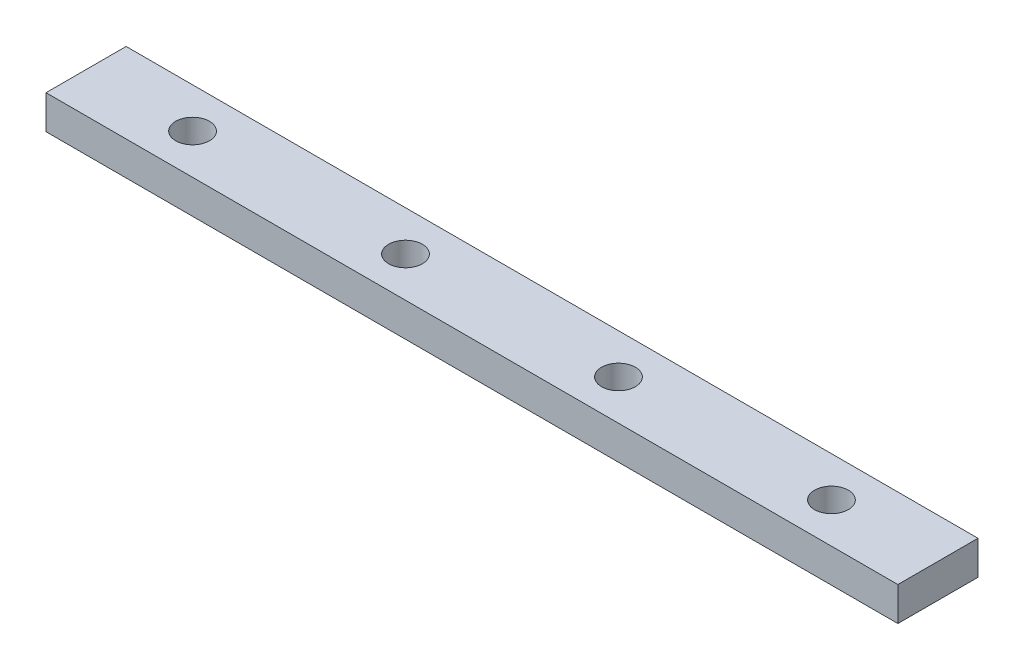
ISO-10303-21;
HEADER;
FILE_DESCRIPTION(('STEP AP214'),'2;1');
FILE_NAME('part.step','',(''),(''),'','','');
FILE_SCHEMA(('AUTOMOTIVE_DESIGN { 1 0 10303 214 1 1 1 1 }'));
ENDSEC;
DATA;
#1=APPLICATION_CONTEXT('core data for automotive mechanical design processes');
#2=APPLICATION_PROTOCOL_DEFINITION('international standard','automotive_design',2000,#1);
#3=PRODUCT_CONTEXT('',#1,'mechanical');
#4=PRODUCT('Part','Part','',(#3));
#5=PRODUCT_RELATED_PRODUCT_CATEGORY('part','',(#4));
#6=PRODUCT_DEFINITION_FORMATION('','',#4);
#7=PRODUCT_DEFINITION_CONTEXT('part definition',#1,'design');
#8=PRODUCT_DEFINITION('design','',#6,#7);
#9=PRODUCT_DEFINITION_SHAPE('','',#8);
#10=(LENGTH_UNIT() NAMED_UNIT(*) SI_UNIT(.MILLI.,.METRE.));
#11=(NAMED_UNIT(*) PLANE_ANGLE_UNIT() SI_UNIT($,.RADIAN.));
#12=(NAMED_UNIT(*) SI_UNIT($,.STERADIAN.) SOLID_ANGLE_UNIT());
#13=UNCERTAINTY_MEASURE_WITH_UNIT(LENGTH_MEASURE(1.E-05),#10,'distance_accuracy_value','');
#14=(GEOMETRIC_REPRESENTATION_CONTEXT(3) GLOBAL_UNCERTAINTY_ASSIGNED_CONTEXT((#13)) GLOBAL_UNIT_ASSIGNED_CONTEXT((#10,
#11,#12)) REPRESENTATION_CONTEXT('',''));
#15=CARTESIAN_POINT('',(0.,0.,0.));
#16=DIRECTION('',(0.,0.,1.));
#17=DIRECTION('',(1.,0.,0.));
#18=AXIS2_PLACEMENT_3D('',#15,#16,#17);
#19=CARTESIAN_POINT('',(320.,0.,0.));
#20=DIRECTION('',(0.,0.,-1.));
#21=DIRECTION('',(-1.,0.,0.));
#22=AXIS2_PLACEMENT_3D('',#19,#20,#21);
#23=PLANE('',#22);
#24=DIRECTION('',(0.,-1.,0.));
#25=VECTOR('',#24,1.);
#26=CARTESIAN_POINT('',(0.,0.,0.));
#27=LINE('',#26,#25);
#28=CARTESIAN_POINT('',(0.,12.7,0.));
#29=VERTEX_POINT('',#28);
#30=CARTESIAN_POINT('',(0.,0.,0.));
#31=VERTEX_POINT('',#30);
#32=EDGE_CURVE('E97',#29,#31,#27,.T.);
#33=ORIENTED_EDGE('',*,*,#32,.T.);
#34=DIRECTION('',(-1.,0.,0.));
#35=VECTOR('',#34,1.);
#36=CARTESIAN_POINT('',(320.,0.,0.));
#37=LINE('',#36,#35);
#38=CARTESIAN_POINT('',(320.,0.,0.));
#39=VERTEX_POINT('',#38);
#40=EDGE_CURVE('E11',#39,#31,#37,.T.);
#41=ORIENTED_EDGE('',*,*,#40,.F.);
#42=DIRECTION('',(0.,-1.,0.));
#43=VECTOR('',#42,1.);
#44=CARTESIAN_POINT('',(320.,0.,0.));
#45=LINE('',#44,#43);
#46=CARTESIAN_POINT('',(320.,12.7,0.));
#47=VERTEX_POINT('',#46);
#48=EDGE_CURVE('E85',#47,#39,#45,.T.);
#49=ORIENTED_EDGE('',*,*,#48,.F.);
#50=DIRECTION('',(-1.,0.,0.));
#51=VECTOR('',#50,1.);
#52=CARTESIAN_POINT('',(320.,12.7,0.));
#53=LINE('',#52,#51);
#54=EDGE_CURVE('E93',#47,#29,#53,.T.);
#55=ORIENTED_EDGE('',*,*,#54,.T.);
#56=EDGE_LOOP('',(#33,#41,#49,#55));
#57=FACE_BOUND('',#56,.T.);
#58=ADVANCED_FACE('F34',(#57),#23,.F.);
#59=CARTESIAN_POINT('',(320.,0.,0.));
#60=DIRECTION('',(0.,1.,0.));
#61=DIRECTION('',(0.,0.,1.));
#62=AXIS2_PLACEMENT_3D('',#59,#60,#61);
#63=PLANE('',#62);
#64=CARTESIAN_POINT('',(40.,0.,-15.05));
#65=DIRECTION('',(0.,1.,0.));
#66=DIRECTION('',(0.,0.,1.));
#67=AXIS2_PLACEMENT_3D('',#64,#65,#66);
#68=CIRCLE('',#67,6.35);
#69=CARTESIAN_POINT('',(40.,0.,-8.69999999999999));
#70=VERTEX_POINT('',#69);
#71=EDGE_CURVE('E100',#70,#70,#68,.T.);
#72=ORIENTED_EDGE('',*,*,#71,.T.);
#73=EDGE_LOOP('',(#72));
#74=FACE_BOUND('',#73,.T.);
#75=CARTESIAN_POINT('',(120.,0.,-15.05));
#76=DIRECTION('',(0.,1.,0.));
#77=DIRECTION('',(0.,0.,1.));
#78=AXIS2_PLACEMENT_3D('',#75,#76,#77);
#79=CIRCLE('',#78,6.35);
#80=CARTESIAN_POINT('',(120.,0.,-8.69999999999999));
#81=VERTEX_POINT('',#80);
#82=EDGE_CURVE('E126',#81,#81,#79,.T.);
#83=ORIENTED_EDGE('',*,*,#82,.T.);
#84=EDGE_LOOP('',(#83));
#85=FACE_BOUND('',#84,.T.);
#86=CARTESIAN_POINT('',(200.,0.,-15.05));
#87=DIRECTION('',(0.,1.,0.));
#88=DIRECTION('',(0.,0.,1.));
#89=AXIS2_PLACEMENT_3D('',#86,#87,#88);
#90=CIRCLE('',#89,6.35);
#91=CARTESIAN_POINT('',(200.,0.,-8.7));
#92=VERTEX_POINT('',#91);
#93=EDGE_CURVE('E120',#92,#92,#90,.T.);
#94=ORIENTED_EDGE('',*,*,#93,.T.);
#95=EDGE_LOOP('',(#94));
#96=FACE_BOUND('',#95,.T.);
#97=CARTESIAN_POINT('',(280.,0.,-15.05));
#98=DIRECTION('',(0.,1.,0.));
#99=DIRECTION('',(0.,0.,1.));
#100=AXIS2_PLACEMENT_3D('',#97,#98,#99);
#101=CIRCLE('',#100,6.35);
#102=CARTESIAN_POINT('',(280.,0.,-8.7));
#103=VERTEX_POINT('',#102);
#104=EDGE_CURVE('E114',#103,#103,#101,.T.);
#105=ORIENTED_EDGE('',*,*,#104,.T.);
#106=EDGE_LOOP('',(#105));
#107=FACE_BOUND('',#106,.T.);
#108=DIRECTION('',(0.,0.,-1.));
#109=VECTOR('',#108,1.);
#110=CARTESIAN_POINT('',(0.,0.,0.));
#111=LINE('',#110,#109);
#112=CARTESIAN_POINT('',(0.,0.,-30.1));
#113=VERTEX_POINT('',#112);
#114=EDGE_CURVE('E89',#31,#113,#111,.T.);
#115=ORIENTED_EDGE('',*,*,#114,.T.);
#116=DIRECTION('',(-1.,0.,0.));
#117=VECTOR('',#116,1.);
#118=CARTESIAN_POINT('',(320.,0.,-30.1));
#119=LINE('',#118,#117);
#120=CARTESIAN_POINT('',(320.,0.,-30.1));
#121=VERTEX_POINT('',#120);
#122=EDGE_CURVE('E42',#121,#113,#119,.T.);
#123=ORIENTED_EDGE('',*,*,#122,.F.);
#124=DIRECTION('',(0.,0.,-1.));
#125=VECTOR('',#124,1.);
#126=CARTESIAN_POINT('',(320.,0.,0.));
#127=LINE('',#126,#125);
#128=EDGE_CURVE('E80',#39,#121,#127,.T.);
#129=ORIENTED_EDGE('',*,*,#128,.F.);
#130=ORIENTED_EDGE('',*,*,#40,.T.);
#131=EDGE_LOOP('',(#115,#123,#129,#130));
#132=FACE_BOUND('',#131,.T.);
#133=ADVANCED_FACE('F88',(#74,#85,#96,#107,#132),#63,.F.);
#134=CARTESIAN_POINT('',(320.,0.,-30.1));
#135=DIRECTION('',(0.,0.,1.));
#136=DIRECTION('',(1.,0.,0.));
#137=AXIS2_PLACEMENT_3D('',#134,#135,#136);
#138=PLANE('',#137);
#139=DIRECTION('',(0.,1.,0.));
#140=VECTOR('',#139,1.);
#141=CARTESIAN_POINT('',(0.,0.,-30.1));
#142=LINE('',#141,#140);
#143=CARTESIAN_POINT('',(0.,12.7,-30.1));
#144=VERTEX_POINT('',#143);
#145=EDGE_CURVE('E67',#113,#144,#142,.T.);
#146=ORIENTED_EDGE('',*,*,#145,.T.);
#147=DIRECTION('',(-1.,0.,0.));
#148=VECTOR('',#147,1.);
#149=CARTESIAN_POINT('',(320.,12.7,-30.1));
#150=LINE('',#149,#148);
#151=CARTESIAN_POINT('',(320.,12.7,-30.1));
#152=VERTEX_POINT('',#151);
#153=EDGE_CURVE('E90',#152,#144,#150,.T.);
#154=ORIENTED_EDGE('',*,*,#153,.F.);
#155=DIRECTION('',(0.,1.,0.));
#156=VECTOR('',#155,1.);
#157=CARTESIAN_POINT('',(320.,0.,-30.1));
#158=LINE('',#157,#156);
#159=EDGE_CURVE('E83',#121,#152,#158,.T.);
#160=ORIENTED_EDGE('',*,*,#159,.F.);
#161=ORIENTED_EDGE('',*,*,#122,.T.);
#162=EDGE_LOOP('',(#146,#154,#160,#161));
#163=FACE_BOUND('',#162,.T.);
#164=ADVANCED_FACE('F91',(#163),#138,.F.);
#165=CARTESIAN_POINT('',(320.,12.7,0.));
#166=DIRECTION('',(0.,-1.,0.));
#167=DIRECTION('',(0.,0.,-1.));
#168=AXIS2_PLACEMENT_3D('',#165,#166,#167);
#169=PLANE('',#168);
#170=CARTESIAN_POINT('',(40.,12.7,-15.05));
#171=DIRECTION('',(0.,1.,0.));
#172=DIRECTION('',(0.,0.,1.));
#173=AXIS2_PLACEMENT_3D('',#170,#171,#172);
#174=CIRCLE('',#173,6.35);
#175=CARTESIAN_POINT('',(40.,12.7,-8.69999999999999));
#176=VERTEX_POINT('',#175);
#177=EDGE_CURVE('E129',#176,#176,#174,.T.);
#178=ORIENTED_EDGE('',*,*,#177,.F.);
#179=EDGE_LOOP('',(#178));
#180=FACE_BOUND('',#179,.T.);
#181=CARTESIAN_POINT('',(120.,12.7,-15.05));
#182=DIRECTION('',(0.,1.,0.));
#183=DIRECTION('',(0.,0.,1.));
#184=AXIS2_PLACEMENT_3D('',#181,#182,#183);
#185=CIRCLE('',#184,6.35);
#186=CARTESIAN_POINT('',(120.,12.7,-8.69999999999999));
#187=VERTEX_POINT('',#186);
#188=EDGE_CURVE('E123',#187,#187,#185,.T.);
#189=ORIENTED_EDGE('',*,*,#188,.F.);
#190=EDGE_LOOP('',(#189));
#191=FACE_BOUND('',#190,.T.);
#192=CARTESIAN_POINT('',(200.,12.7,-15.05));
#193=DIRECTION('',(0.,1.,0.));
#194=DIRECTION('',(0.,0.,1.));
#195=AXIS2_PLACEMENT_3D('',#192,#193,#194);
#196=CIRCLE('',#195,6.35);
#197=CARTESIAN_POINT('',(200.,12.7,-8.7));
#198=VERTEX_POINT('',#197);
#199=EDGE_CURVE('E117',#198,#198,#196,.T.);
#200=ORIENTED_EDGE('',*,*,#199,.F.);
#201=EDGE_LOOP('',(#200));
#202=FACE_BOUND('',#201,.T.);
#203=CARTESIAN_POINT('',(280.,12.7,-15.05));
#204=DIRECTION('',(0.,1.,0.));
#205=DIRECTION('',(0.,0.,1.));
#206=AXIS2_PLACEMENT_3D('',#203,#204,#205);
#207=CIRCLE('',#206,6.35);
#208=CARTESIAN_POINT('',(280.,12.7,-8.7));
#209=VERTEX_POINT('',#208);
#210=EDGE_CURVE('E111',#209,#209,#207,.T.);
#211=ORIENTED_EDGE('',*,*,#210,.F.);
#212=EDGE_LOOP('',(#211));
#213=FACE_BOUND('',#212,.T.);
#214=DIRECTION('',(0.,0.,1.));
#215=VECTOR('',#214,1.);
#216=CARTESIAN_POINT('',(0.,12.7,0.));
#217=LINE('',#216,#215);
#218=EDGE_CURVE('E73',#144,#29,#217,.T.);
#219=ORIENTED_EDGE('',*,*,#218,.T.);
#220=ORIENTED_EDGE('',*,*,#54,.F.);
#221=DIRECTION('',(0.,0.,1.));
#222=VECTOR('',#221,1.);
#223=CARTESIAN_POINT('',(320.,12.7,0.));
#224=LINE('',#223,#222);
#225=EDGE_CURVE('E50',#152,#47,#224,.T.);
#226=ORIENTED_EDGE('',*,*,#225,.F.);
#227=ORIENTED_EDGE('',*,*,#153,.T.);
#228=EDGE_LOOP('',(#219,#220,#226,#227));
#229=FACE_BOUND('',#228,.T.);
#230=ADVANCED_FACE('F105',(#180,#191,#202,#213,#229),#169,.F.);
#231=CARTESIAN_POINT('',(320.,0.,0.));
#232=DIRECTION('',(-1.,0.,0.));
#233=DIRECTION('',(0.,0.,1.));
#234=AXIS2_PLACEMENT_3D('',#231,#232,#233);
#235=PLANE('',#234);
#236=ORIENTED_EDGE('',*,*,#48,.T.);
#237=ORIENTED_EDGE('',*,*,#128,.T.);
#238=ORIENTED_EDGE('',*,*,#159,.T.);
#239=ORIENTED_EDGE('',*,*,#225,.T.);
#240=EDGE_LOOP('',(#236,#237,#238,#239));
#241=FACE_BOUND('',#240,.T.);
#242=ADVANCED_FACE('F81',(#241),#235,.F.);
#243=CARTESIAN_POINT('',(0.,0.,0.));
#244=DIRECTION('',(-1.,0.,0.));
#245=DIRECTION('',(0.,0.,1.));
#246=AXIS2_PLACEMENT_3D('',#243,#244,#245);
#247=PLANE('',#246);
#248=ORIENTED_EDGE('',*,*,#32,.F.);
#249=ORIENTED_EDGE('',*,*,#218,.F.);
#250=ORIENTED_EDGE('',*,*,#145,.F.);
#251=ORIENTED_EDGE('',*,*,#114,.F.);
#252=EDGE_LOOP('',(#248,#249,#250,#251));
#253=FACE_BOUND('',#252,.T.);
#254=ADVANCED_FACE('F108',(#253),#247,.T.);
#255=CARTESIAN_POINT('',(280.,0.,-15.05));
#256=DIRECTION('',(0.,1.,0.));
#257=DIRECTION('',(0.,0.,1.));
#258=AXIS2_PLACEMENT_3D('',#255,#256,#257);
#259=CYLINDRICAL_SURFACE('',#258,6.35);
#260=ORIENTED_EDGE('',*,*,#104,.F.);
#261=EDGE_LOOP('',(#260));
#262=FACE_BOUND('',#261,.T.);
#263=ORIENTED_EDGE('',*,*,#210,.T.);
#264=EDGE_LOOP('',(#263));
#265=FACE_BOUND('',#264,.T.);
#266=ADVANCED_FACE('F153',(#262,#265),#259,.F.);
#267=CARTESIAN_POINT('',(200.,0.,-15.05));
#268=DIRECTION('',(0.,1.,0.));
#269=DIRECTION('',(0.,0.,1.));
#270=AXIS2_PLACEMENT_3D('',#267,#268,#269);
#271=CYLINDRICAL_SURFACE('',#270,6.35);
#272=ORIENTED_EDGE('',*,*,#93,.F.);
#273=EDGE_LOOP('',(#272));
#274=FACE_BOUND('',#273,.T.);
#275=ORIENTED_EDGE('',*,*,#199,.T.);
#276=EDGE_LOOP('',(#275));
#277=FACE_BOUND('',#276,.T.);
#278=ADVANCED_FACE('F155',(#274,#277),#271,.F.);
#279=CARTESIAN_POINT('',(120.,0.,-15.05));
#280=DIRECTION('',(0.,1.,0.));
#281=DIRECTION('',(0.,0.,1.));
#282=AXIS2_PLACEMENT_3D('',#279,#280,#281);
#283=CYLINDRICAL_SURFACE('',#282,6.35);
#284=ORIENTED_EDGE('',*,*,#82,.F.);
#285=EDGE_LOOP('',(#284));
#286=FACE_BOUND('',#285,.T.);
#287=ORIENTED_EDGE('',*,*,#188,.T.);
#288=EDGE_LOOP('',(#287));
#289=FACE_BOUND('',#288,.T.);
#290=ADVANCED_FACE('F140',(#286,#289),#283,.F.);
#291=CARTESIAN_POINT('',(40.,0.,-15.05));
#292=DIRECTION('',(0.,1.,0.));
#293=DIRECTION('',(0.,0.,1.));
#294=AXIS2_PLACEMENT_3D('',#291,#292,#293);
#295=CYLINDRICAL_SURFACE('',#294,6.35);
#296=ORIENTED_EDGE('',*,*,#71,.F.);
#297=EDGE_LOOP('',(#296));
#298=FACE_BOUND('',#297,.T.);
#299=ORIENTED_EDGE('',*,*,#177,.T.);
#300=EDGE_LOOP('',(#299));
#301=FACE_BOUND('',#300,.T.);
#302=ADVANCED_FACE('F137',(#298,#301),#295,.F.);
#303=CLOSED_SHELL('',(#58,#133,#164,#230,#242,#254,#266,#278,#290,#302));
#304=MANIFOLD_SOLID_BREP('B2',#303);
#305=ADVANCED_BREP_SHAPE_REPRESENTATION('',(#18,#304),#14);
#306=SHAPE_DEFINITION_REPRESENTATION(#9,#305);
ENDSEC;
END-ISO-10303-21;
